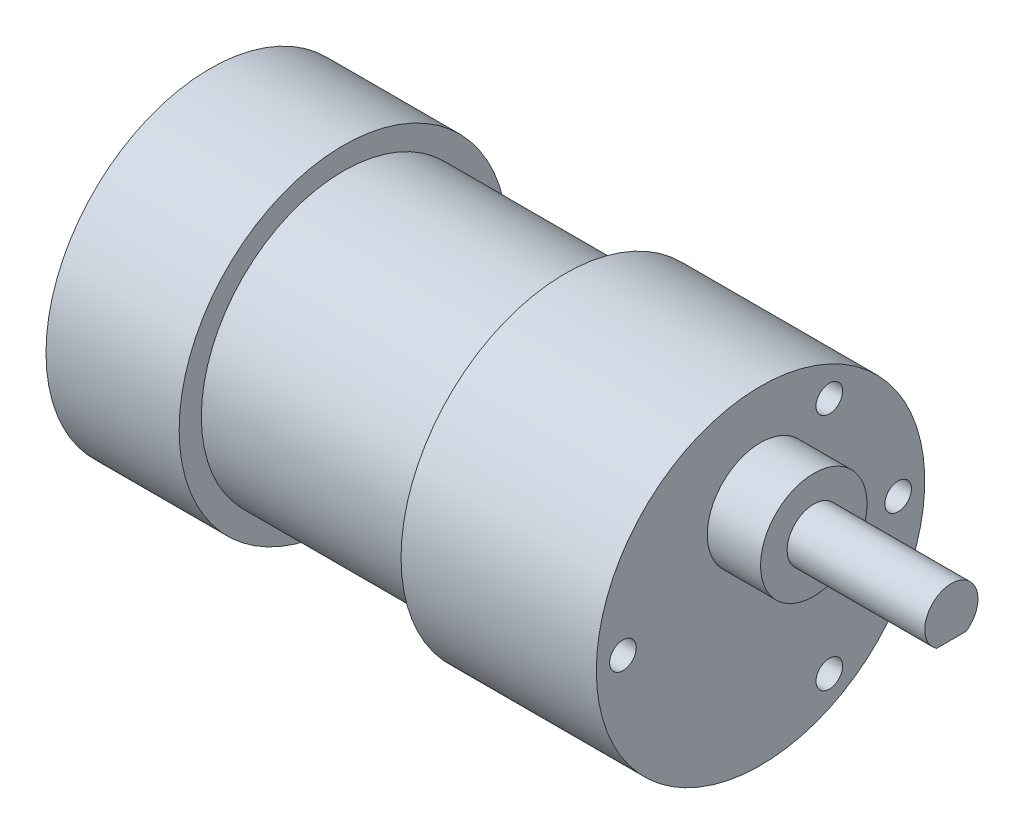
ISO-10303-21;
HEADER;
FILE_DESCRIPTION(('STEP AP214'),'2;1');
FILE_NAME('part.step','',(''),(''),'','','');
FILE_SCHEMA(('AUTOMOTIVE_DESIGN { 1 0 10303 214 1 1 1 1 }'));
ENDSEC;
DATA;
#1=APPLICATION_CONTEXT('core data for automotive mechanical design processes');
#2=APPLICATION_PROTOCOL_DEFINITION('international standard','automotive_design',2000,#1);
#3=PRODUCT_CONTEXT('',#1,'mechanical');
#4=PRODUCT('Part','Part','',(#3));
#5=PRODUCT_RELATED_PRODUCT_CATEGORY('part','',(#4));
#6=PRODUCT_DEFINITION_FORMATION('','',#4);
#7=PRODUCT_DEFINITION_CONTEXT('part definition',#1,'design');
#8=PRODUCT_DEFINITION('design','',#6,#7);
#9=PRODUCT_DEFINITION_SHAPE('','',#8);
#10=(LENGTH_UNIT() NAMED_UNIT(*) SI_UNIT(.MILLI.,.METRE.));
#11=(NAMED_UNIT(*) PLANE_ANGLE_UNIT() SI_UNIT($,.RADIAN.));
#12=(NAMED_UNIT(*) SI_UNIT($,.STERADIAN.) SOLID_ANGLE_UNIT());
#13=UNCERTAINTY_MEASURE_WITH_UNIT(LENGTH_MEASURE(1.E-05),#10,'distance_accuracy_value','');
#14=(GEOMETRIC_REPRESENTATION_CONTEXT(3) GLOBAL_UNCERTAINTY_ASSIGNED_CONTEXT((#13)) GLOBAL_UNIT_ASSIGNED_CONTEXT((#10,
#11,#12)) REPRESENTATION_CONTEXT('',''));
#15=CARTESIAN_POINT('',(0.,0.,0.));
#16=DIRECTION('',(0.,0.,1.));
#17=DIRECTION('',(1.,0.,0.));
#18=AXIS2_PLACEMENT_3D('',#15,#16,#17);
#19=CARTESIAN_POINT('',(0.,0.,0.));
#20=DIRECTION('',(-1.,0.,0.));
#21=DIRECTION('',(0.,0.,1.));
#22=AXIS2_PLACEMENT_3D('',#19,#20,#21);
#23=CYLINDRICAL_SURFACE('',#22,16.);
#24=CARTESIAN_POINT('',(37.,0.,0.));
#25=DIRECTION('',(-1.,0.,0.));
#26=DIRECTION('',(0.,0.,1.));
#27=AXIS2_PLACEMENT_3D('',#24,#25,#26);
#28=CIRCLE('',#27,16.);
#29=CARTESIAN_POINT('',(37.,0.,16.));
#30=VERTEX_POINT('',#29);
#31=EDGE_CURVE('E89',#30,#30,#28,.T.);
#32=ORIENTED_EDGE('',*,*,#31,.T.);
#33=EDGE_LOOP('',(#32));
#34=FACE_BOUND('',#33,.T.);
#35=CARTESIAN_POINT('',(12.,0.,0.));
#36=DIRECTION('',(-1.,0.,0.));
#37=DIRECTION('',(0.,0.,1.));
#38=AXIS2_PLACEMENT_3D('',#35,#36,#37);
#39=CIRCLE('',#38,16.);
#40=CARTESIAN_POINT('',(12.,0.,16.));
#41=VERTEX_POINT('',#40);
#42=EDGE_CURVE('E11',#41,#41,#39,.T.);
#43=ORIENTED_EDGE('',*,*,#42,.F.);
#44=EDGE_LOOP('',(#43));
#45=FACE_BOUND('',#44,.T.);
#46=ADVANCED_FACE('F34',(#34,#45),#23,.T.);
#47=CARTESIAN_POINT('',(65.,7.,0.));
#48=DIRECTION('',(1.,0.,0.));
#49=DIRECTION('',(0.,0.,-1.));
#50=AXIS2_PLACEMENT_3D('',#47,#48,#49);
#51=PLANE('',#50);
#52=CARTESIAN_POINT('',(65.,7.,0.));
#53=DIRECTION('',(1.,0.,0.));
#54=DIRECTION('',(0.,0.,-1.));
#55=AXIS2_PLACEMENT_3D('',#52,#53,#54);
#56=CIRCLE('',#55,6.);
#57=CARTESIAN_POINT('',(65.,7.,-6.));
#58=VERTEX_POINT('',#57);
#59=EDGE_CURVE('E74',#58,#58,#56,.T.);
#60=ORIENTED_EDGE('',*,*,#59,.T.);
#61=EDGE_LOOP('',(#60));
#62=FACE_BOUND('',#61,.T.);
#63=CARTESIAN_POINT('',(65.,7.,0.));
#64=DIRECTION('',(1.,0.,0.));
#65=DIRECTION('',(0.,0.,-1.));
#66=AXIS2_PLACEMENT_3D('',#63,#64,#65);
#67=CIRCLE('',#66,3.);
#68=CARTESIAN_POINT('',(65.,7.,-3.));
#69=VERTEX_POINT('',#68);
#70=EDGE_CURVE('E75',#69,#69,#67,.T.);
#71=ORIENTED_EDGE('',*,*,#70,.F.);
#72=EDGE_LOOP('',(#71));
#73=FACE_BOUND('',#72,.T.);
#74=ADVANCED_FACE('F100',(#62,#73),#51,.T.);
#75=CARTESIAN_POINT('',(59.,18.5,0.));
#76=DIRECTION('',(-1.,0.,0.));
#77=DIRECTION('',(0.,0.,1.));
#78=AXIS2_PLACEMENT_3D('',#75,#76,#77);
#79=PLANE('',#78);
#80=CARTESIAN_POINT('',(59.,0.,15.5));
#81=DIRECTION('',(1.,0.,0.));
#82=DIRECTION('',(0.,0.,-1.));
#83=AXIS2_PLACEMENT_3D('',#80,#81,#82);
#84=CIRCLE('',#83,1.5);
#85=CARTESIAN_POINT('',(59.,0.,14.));
#86=VERTEX_POINT('',#85);
#87=EDGE_CURVE('E312',#86,#86,#84,.T.);
#88=ORIENTED_EDGE('',*,*,#87,.F.);
#89=EDGE_LOOP('',(#88));
#90=FACE_BOUND('',#89,.T.);
#91=CARTESIAN_POINT('',(59.,-13.4233937586588,-7.74999999999997));
#92=DIRECTION('',(1.,0.,0.));
#93=DIRECTION('',(0.,0.,-1.));
#94=AXIS2_PLACEMENT_3D('',#91,#92,#93);
#95=CIRCLE('',#94,1.5);
#96=CARTESIAN_POINT('',(59.,-13.4233937586588,-9.24999999999997));
#97=VERTEX_POINT('',#96);
#98=EDGE_CURVE('E318',#97,#97,#95,.T.);
#99=ORIENTED_EDGE('',*,*,#98,.F.);
#100=EDGE_LOOP('',(#99));
#101=FACE_BOUND('',#100,.T.);
#102=CARTESIAN_POINT('',(59.,13.4233937586588,-7.74999999999997));
#103=DIRECTION('',(1.,0.,0.));
#104=DIRECTION('',(0.,0.,-1.));
#105=AXIS2_PLACEMENT_3D('',#102,#103,#104);
#106=CIRCLE('',#105,1.5);
#107=CARTESIAN_POINT('',(59.,13.4233937586588,-9.24999999999997));
#108=VERTEX_POINT('',#107);
#109=EDGE_CURVE('E324',#108,#108,#106,.T.);
#110=ORIENTED_EDGE('',*,*,#109,.F.);
#111=EDGE_LOOP('',(#110));
#112=FACE_BOUND('',#111,.T.);
#113=CARTESIAN_POINT('',(59.,0.,-15.5));
#114=DIRECTION('',(1.,0.,0.));
#115=DIRECTION('',(0.,0.,-1.));
#116=AXIS2_PLACEMENT_3D('',#113,#114,#115);
#117=CIRCLE('',#116,1.5);
#118=CARTESIAN_POINT('',(59.,0.,-17.));
#119=VERTEX_POINT('',#118);
#120=EDGE_CURVE('E330',#119,#119,#117,.T.);
#121=ORIENTED_EDGE('',*,*,#120,.F.);
#122=EDGE_LOOP('',(#121));
#123=FACE_BOUND('',#122,.T.);
#124=CARTESIAN_POINT('',(59.,0.,0.));
#125=DIRECTION('',(-1.,0.,0.));
#126=DIRECTION('',(0.,0.,1.));
#127=AXIS2_PLACEMENT_3D('',#124,#125,#126);
#128=CIRCLE('',#127,18.5);
#129=CARTESIAN_POINT('',(59.,0.,18.5));
#130=VERTEX_POINT('',#129);
#131=EDGE_CURVE('E78',#130,#130,#128,.T.);
#132=ORIENTED_EDGE('',*,*,#131,.F.);
#133=EDGE_LOOP('',(#132));
#134=FACE_BOUND('',#133,.T.);
#135=CARTESIAN_POINT('',(59.,7.,0.));
#136=DIRECTION('',(-1.,0.,0.));
#137=DIRECTION('',(0.,0.,1.));
#138=AXIS2_PLACEMENT_3D('',#135,#136,#137);
#139=CIRCLE('',#138,6.);
#140=CARTESIAN_POINT('',(59.,7.,6.));
#141=VERTEX_POINT('',#140);
#142=EDGE_CURVE('E64',#141,#141,#139,.F.);
#143=ORIENTED_EDGE('',*,*,#142,.F.);
#144=EDGE_LOOP('',(#143));
#145=FACE_BOUND('',#144,.T.);
#146=ADVANCED_FACE('F97',(#90,#101,#112,#123,#134,#145),#79,.F.);
#147=CARTESIAN_POINT('',(37.,16.,0.));
#148=DIRECTION('',(1.,0.,0.));
#149=DIRECTION('',(0.,0.,-1.));
#150=AXIS2_PLACEMENT_3D('',#147,#148,#149);
#151=PLANE('',#150);
#152=ORIENTED_EDGE('',*,*,#31,.F.);
#153=EDGE_LOOP('',(#152));
#154=FACE_BOUND('',#153,.T.);
#155=CARTESIAN_POINT('',(37.,0.,0.));
#156=DIRECTION('',(-1.,0.,0.));
#157=DIRECTION('',(0.,0.,1.));
#158=AXIS2_PLACEMENT_3D('',#155,#156,#157);
#159=CIRCLE('',#158,18.5);
#160=CARTESIAN_POINT('',(37.,0.,18.5));
#161=VERTEX_POINT('',#160);
#162=EDGE_CURVE('E86',#161,#161,#159,.T.);
#163=ORIENTED_EDGE('',*,*,#162,.T.);
#164=EDGE_LOOP('',(#163));
#165=FACE_BOUND('',#164,.T.);
#166=ADVANCED_FACE('F99',(#154,#165),#151,.F.);
#167=CARTESIAN_POINT('',(0.,0.,0.));
#168=DIRECTION('',(-1.,0.,0.));
#169=DIRECTION('',(0.,0.,1.));
#170=AXIS2_PLACEMENT_3D('',#167,#168,#169);
#171=CYLINDRICAL_SURFACE('',#170,18.5);
#172=ORIENTED_EDGE('',*,*,#162,.F.);
#173=EDGE_LOOP('',(#172));
#174=FACE_BOUND('',#173,.T.);
#175=ORIENTED_EDGE('',*,*,#131,.T.);
#176=EDGE_LOOP('',(#175));
#177=FACE_BOUND('',#176,.T.);
#178=ADVANCED_FACE('F107',(#174,#177),#171,.T.);
#179=CARTESIAN_POINT('',(65.,7.,0.));
#180=DIRECTION('',(-1.,0.,0.));
#181=DIRECTION('',(0.,0.,1.));
#182=AXIS2_PLACEMENT_3D('',#179,#180,#181);
#183=CYLINDRICAL_SURFACE('',#182,6.);
#184=ORIENTED_EDGE('',*,*,#59,.F.);
#185=EDGE_LOOP('',(#184));
#186=FACE_BOUND('',#185,.T.);
#187=ORIENTED_EDGE('',*,*,#142,.T.);
#188=EDGE_LOOP('',(#187));
#189=FACE_BOUND('',#188,.T.);
#190=ADVANCED_FACE('F95',(#186,#189),#183,.T.);
#191=CARTESIAN_POINT('',(80.5,7.,0.));
#192=DIRECTION('',(-1.,0.,0.));
#193=DIRECTION('',(0.,0.,1.));
#194=AXIS2_PLACEMENT_3D('',#191,#192,#193);
#195=CYLINDRICAL_SURFACE('',#194,3.);
#196=CARTESIAN_POINT('',(80.5,7.,0.));
#197=DIRECTION('',(1.,0.,0.));
#198=DIRECTION('',(0.,0.,-1.));
#199=AXIS2_PLACEMENT_3D('',#196,#197,#198);
#200=CIRCLE('',#199,3.);
#201=CARTESIAN_POINT('',(80.5,4.5,-1.6583123951777));
#202=VERTEX_POINT('',#201);
#203=CARTESIAN_POINT('',(80.5,4.5,1.6583123951777));
#204=VERTEX_POINT('',#203);
#205=EDGE_CURVE('E70',#202,#204,#200,.T.);
#206=ORIENTED_EDGE('',*,*,#205,.F.);
#207=DIRECTION('',(-1.,0.,0.));
#208=VECTOR('',#207,1.);
#209=CARTESIAN_POINT('',(80.5,4.5,-1.6583123951777));
#210=LINE('',#209,#208);
#211=CARTESIAN_POINT('',(68.5,4.5,-1.6583123951777));
#212=VERTEX_POINT('',#211);
#213=EDGE_CURVE('E48',#202,#212,#210,.T.);
#214=ORIENTED_EDGE('',*,*,#213,.T.);
#215=CARTESIAN_POINT('',(68.5,7.,0.));
#216=DIRECTION('',(-1.,0.,0.));
#217=DIRECTION('',(0.,0.,1.));
#218=AXIS2_PLACEMENT_3D('',#215,#216,#217);
#219=CIRCLE('',#218,3.);
#220=CARTESIAN_POINT('',(68.5,4.5,1.6583123951777));
#221=VERTEX_POINT('',#220);
#222=EDGE_CURVE('E41',#212,#221,#219,.T.);
#223=ORIENTED_EDGE('',*,*,#222,.T.);
#224=DIRECTION('',(-1.,0.,0.));
#225=VECTOR('',#224,1.);
#226=CARTESIAN_POINT('',(80.5,4.5,1.6583123951777));
#227=LINE('',#226,#225);
#228=EDGE_CURVE('E53',#221,#204,#227,.F.);
#229=ORIENTED_EDGE('',*,*,#228,.T.);
#230=EDGE_LOOP('',(#206,#214,#223,#229));
#231=FACE_BOUND('',#230,.T.);
#232=ORIENTED_EDGE('',*,*,#70,.T.);
#233=EDGE_LOOP('',(#232));
#234=FACE_BOUND('',#233,.T.);
#235=ADVANCED_FACE('F68',(#231,#234),#195,.T.);
#236=CARTESIAN_POINT('',(80.5,7.,0.));
#237=DIRECTION('',(1.,0.,0.));
#238=DIRECTION('',(0.,0.,-1.));
#239=AXIS2_PLACEMENT_3D('',#236,#237,#238);
#240=PLANE('',#239);
#241=DIRECTION('',(0.,0.,1.));
#242=VECTOR('',#241,1.);
#243=CARTESIAN_POINT('',(80.5,4.5,0.));
#244=LINE('',#243,#242);
#245=EDGE_CURVE('E59',#202,#204,#244,.T.);
#246=ORIENTED_EDGE('',*,*,#245,.F.);
#247=ORIENTED_EDGE('',*,*,#205,.T.);
#248=EDGE_LOOP('',(#246,#247));
#249=FACE_BOUND('',#248,.T.);
#250=ADVANCED_FACE('F73',(#249),#240,.T.);
#251=CARTESIAN_POINT('',(68.5,4.,-7.75));
#252=DIRECTION('',(-1.,0.,0.));
#253=DIRECTION('',(0.,0.,1.));
#254=AXIS2_PLACEMENT_3D('',#251,#252,#253);
#255=PLANE('',#254);
#256=DIRECTION('',(0.,0.,1.));
#257=VECTOR('',#256,1.);
#258=CARTESIAN_POINT('',(68.5,4.5,-7.75));
#259=LINE('',#258,#257);
#260=EDGE_CURVE('E71',#212,#221,#259,.T.);
#261=ORIENTED_EDGE('',*,*,#260,.T.);
#262=ORIENTED_EDGE('',*,*,#222,.F.);
#263=EDGE_LOOP('',(#261,#262));
#264=FACE_BOUND('',#263,.T.);
#265=ADVANCED_FACE('F169',(#264),#255,.F.);
#266=CARTESIAN_POINT('',(80.5,4.5,-7.75));
#267=DIRECTION('',(0.,1.,0.));
#268=DIRECTION('',(-1.,0.,0.));
#269=AXIS2_PLACEMENT_3D('',#266,#267,#268);
#270=PLANE('',#269);
#271=ORIENTED_EDGE('',*,*,#245,.T.);
#272=ORIENTED_EDGE('',*,*,#228,.F.);
#273=ORIENTED_EDGE('',*,*,#260,.F.);
#274=ORIENTED_EDGE('',*,*,#213,.F.);
#275=EDGE_LOOP('',(#271,#272,#273,#274));
#276=FACE_BOUND('',#275,.T.);
#277=ADVANCED_FACE('F60',(#276),#270,.F.);
#278=CARTESIAN_POINT('',(55.5,0.,-15.5));
#279=DIRECTION('',(1.,0.,0.));
#280=DIRECTION('',(0.,0.,-1.));
#281=AXIS2_PLACEMENT_3D('',#278,#279,#280);
#282=CYLINDRICAL_SURFACE('',#281,1.5);
#283=CARTESIAN_POINT('',(55.5,0.,-15.5));
#284=DIRECTION('',(1.,0.,0.));
#285=DIRECTION('',(0.,0.,-1.));
#286=AXIS2_PLACEMENT_3D('',#283,#284,#285);
#287=CIRCLE('',#286,1.5);
#288=CARTESIAN_POINT('',(55.5,0.,-17.));
#289=VERTEX_POINT('',#288);
#290=EDGE_CURVE('E333',#289,#289,#287,.T.);
#291=ORIENTED_EDGE('',*,*,#290,.F.);
#292=EDGE_LOOP('',(#291));
#293=FACE_BOUND('',#292,.T.);
#294=ORIENTED_EDGE('',*,*,#120,.T.);
#295=EDGE_LOOP('',(#294));
#296=FACE_BOUND('',#295,.T.);
#297=ADVANCED_FACE('F164',(#293,#296),#282,.F.);
#298=CARTESIAN_POINT('',(55.5,0.,-15.5));
#299=DIRECTION('',(1.,0.,0.));
#300=DIRECTION('',(0.,0.,-1.));
#301=AXIS2_PLACEMENT_3D('',#298,#299,#300);
#302=PLANE('',#301);
#303=ORIENTED_EDGE('',*,*,#290,.T.);
#304=EDGE_LOOP('',(#303));
#305=FACE_BOUND('',#304,.T.);
#306=ADVANCED_FACE('F160',(#305),#302,.T.);
#307=CARTESIAN_POINT('',(55.5,13.4233937586588,-7.74999999999997));
#308=DIRECTION('',(1.,0.,0.));
#309=DIRECTION('',(0.,0.,-1.));
#310=AXIS2_PLACEMENT_3D('',#307,#308,#309);
#311=CYLINDRICAL_SURFACE('',#310,1.5);
#312=CARTESIAN_POINT('',(55.5,13.4233937586588,-7.74999999999997));
#313=DIRECTION('',(1.,0.,0.));
#314=DIRECTION('',(0.,0.,-1.));
#315=AXIS2_PLACEMENT_3D('',#312,#313,#314);
#316=CIRCLE('',#315,1.5);
#317=CARTESIAN_POINT('',(55.5,13.4233937586588,-9.24999999999997));
#318=VERTEX_POINT('',#317);
#319=EDGE_CURVE('E327',#318,#318,#316,.T.);
#320=ORIENTED_EDGE('',*,*,#319,.F.);
#321=EDGE_LOOP('',(#320));
#322=FACE_BOUND('',#321,.T.);
#323=ORIENTED_EDGE('',*,*,#109,.T.);
#324=EDGE_LOOP('',(#323));
#325=FACE_BOUND('',#324,.T.);
#326=ADVANCED_FACE('F156',(#322,#325),#311,.F.);
#327=CARTESIAN_POINT('',(55.5,13.4233937586588,-7.74999999999997));
#328=DIRECTION('',(1.,0.,0.));
#329=DIRECTION('',(0.,0.,-1.));
#330=AXIS2_PLACEMENT_3D('',#327,#328,#329);
#331=PLANE('',#330);
#332=ORIENTED_EDGE('',*,*,#319,.T.);
#333=EDGE_LOOP('',(#332));
#334=FACE_BOUND('',#333,.T.);
#335=ADVANCED_FACE('F152',(#334),#331,.T.);
#336=CARTESIAN_POINT('',(55.5,-13.4233937586588,-7.74999999999997));
#337=DIRECTION('',(1.,0.,0.));
#338=DIRECTION('',(0.,0.,-1.));
#339=AXIS2_PLACEMENT_3D('',#336,#337,#338);
#340=CYLINDRICAL_SURFACE('',#339,1.5);
#341=CARTESIAN_POINT('',(55.5,-13.4233937586588,-7.74999999999997));
#342=DIRECTION('',(1.,0.,0.));
#343=DIRECTION('',(0.,0.,-1.));
#344=AXIS2_PLACEMENT_3D('',#341,#342,#343);
#345=CIRCLE('',#344,1.5);
#346=CARTESIAN_POINT('',(55.5,-13.4233937586588,-9.24999999999997));
#347=VERTEX_POINT('',#346);
#348=EDGE_CURVE('E321',#347,#347,#345,.T.);
#349=ORIENTED_EDGE('',*,*,#348,.F.);
#350=EDGE_LOOP('',(#349));
#351=FACE_BOUND('',#350,.T.);
#352=ORIENTED_EDGE('',*,*,#98,.T.);
#353=EDGE_LOOP('',(#352));
#354=FACE_BOUND('',#353,.T.);
#355=ADVANCED_FACE('F148',(#351,#354),#340,.F.);
#356=CARTESIAN_POINT('',(55.5,-13.4233937586588,-7.74999999999997));
#357=DIRECTION('',(1.,0.,0.));
#358=DIRECTION('',(0.,0.,-1.));
#359=AXIS2_PLACEMENT_3D('',#356,#357,#358);
#360=PLANE('',#359);
#361=ORIENTED_EDGE('',*,*,#348,.T.);
#362=EDGE_LOOP('',(#361));
#363=FACE_BOUND('',#362,.T.);
#364=ADVANCED_FACE('F144',(#363),#360,.T.);
#365=CARTESIAN_POINT('',(55.5,0.,15.5));
#366=DIRECTION('',(1.,0.,0.));
#367=DIRECTION('',(0.,0.,-1.));
#368=AXIS2_PLACEMENT_3D('',#365,#366,#367);
#369=CYLINDRICAL_SURFACE('',#368,1.5);
#370=CARTESIAN_POINT('',(55.5,0.,15.5));
#371=DIRECTION('',(1.,0.,0.));
#372=DIRECTION('',(0.,0.,-1.));
#373=AXIS2_PLACEMENT_3D('',#370,#371,#372);
#374=CIRCLE('',#373,1.5);
#375=CARTESIAN_POINT('',(55.5,0.,14.));
#376=VERTEX_POINT('',#375);
#377=EDGE_CURVE('E315',#376,#376,#374,.T.);
#378=ORIENTED_EDGE('',*,*,#377,.F.);
#379=EDGE_LOOP('',(#378));
#380=FACE_BOUND('',#379,.T.);
#381=ORIENTED_EDGE('',*,*,#87,.T.);
#382=EDGE_LOOP('',(#381));
#383=FACE_BOUND('',#382,.T.);
#384=ADVANCED_FACE('F136',(#380,#383),#369,.F.);
#385=CARTESIAN_POINT('',(55.5,0.,15.5));
#386=DIRECTION('',(1.,0.,0.));
#387=DIRECTION('',(0.,0.,-1.));
#388=AXIS2_PLACEMENT_3D('',#385,#386,#387);
#389=PLANE('',#388);
#390=ORIENTED_EDGE('',*,*,#377,.T.);
#391=EDGE_LOOP('',(#390));
#392=FACE_BOUND('',#391,.T.);
#393=ADVANCED_FACE('F126',(#392),#389,.T.);
#394=CARTESIAN_POINT('',(12.,0.,0.));
#395=DIRECTION('',(-1.,0.,0.));
#396=DIRECTION('',(0.,0.,1.));
#397=AXIS2_PLACEMENT_3D('',#394,#395,#396);
#398=PLANE('',#397);
#399=CARTESIAN_POINT('',(12.,0.,0.));
#400=DIRECTION('',(-1.,0.,0.));
#401=DIRECTION('',(0.,0.,1.));
#402=AXIS2_PLACEMENT_3D('',#399,#400,#401);
#403=CIRCLE('',#402,18.5);
#404=CARTESIAN_POINT('',(12.,0.,18.5));
#405=VERTEX_POINT('',#404);
#406=EDGE_CURVE('E309',#405,#405,#403,.T.);
#407=ORIENTED_EDGE('',*,*,#406,.F.);
#408=EDGE_LOOP('',(#407));
#409=FACE_BOUND('',#408,.T.);
#410=ORIENTED_EDGE('',*,*,#42,.T.);
#411=EDGE_LOOP('',(#410));
#412=FACE_BOUND('',#411,.T.);
#413=ADVANCED_FACE('F123',(#409,#412),#398,.F.);
#414=CARTESIAN_POINT('',(12.,0.,0.));
#415=DIRECTION('',(-1.,0.,0.));
#416=DIRECTION('',(0.,0.,1.));
#417=AXIS2_PLACEMENT_3D('',#414,#415,#416);
#418=CYLINDRICAL_SURFACE('',#417,18.5);
#419=ORIENTED_EDGE('',*,*,#406,.T.);
#420=EDGE_LOOP('',(#419));
#421=FACE_BOUND('',#420,.T.);
#422=CARTESIAN_POINT('',(-3.,0.,0.));
#423=DIRECTION('',(-1.,0.,0.));
#424=DIRECTION('',(0.,0.,1.));
#425=AXIS2_PLACEMENT_3D('',#422,#423,#424);
#426=CIRCLE('',#425,18.5);
#427=CARTESIAN_POINT('',(-3.,0.,18.5));
#428=VERTEX_POINT('',#427);
#429=EDGE_CURVE('E307',#428,#428,#426,.T.);
#430=ORIENTED_EDGE('',*,*,#429,.F.);
#431=EDGE_LOOP('',(#430));
#432=FACE_BOUND('',#431,.T.);
#433=ADVANCED_FACE('F125',(#421,#432),#418,.T.);
#434=CARTESIAN_POINT('',(-3.,0.,0.));
#435=DIRECTION('',(-1.,0.,0.));
#436=DIRECTION('',(0.,0.,1.));
#437=AXIS2_PLACEMENT_3D('',#434,#435,#436);
#438=PLANE('',#437);
#439=ORIENTED_EDGE('',*,*,#429,.T.);
#440=EDGE_LOOP('',(#439));
#441=FACE_BOUND('',#440,.T.);
#442=ADVANCED_FACE('F133',(#441),#438,.T.);
#443=CLOSED_SHELL('',(#46,#74,#146,#166,#178,#190,#235,#250,#265,#277,#297,#306,#326,#335,#355,
#364,#384,#393,#413,#433,#442));
#444=MANIFOLD_SOLID_BREP('B2',#443);
#445=ADVANCED_BREP_SHAPE_REPRESENTATION('',(#18,#444),#14);
#446=SHAPE_DEFINITION_REPRESENTATION(#9,#445);
ENDSEC;
END-ISO-10303-21;
